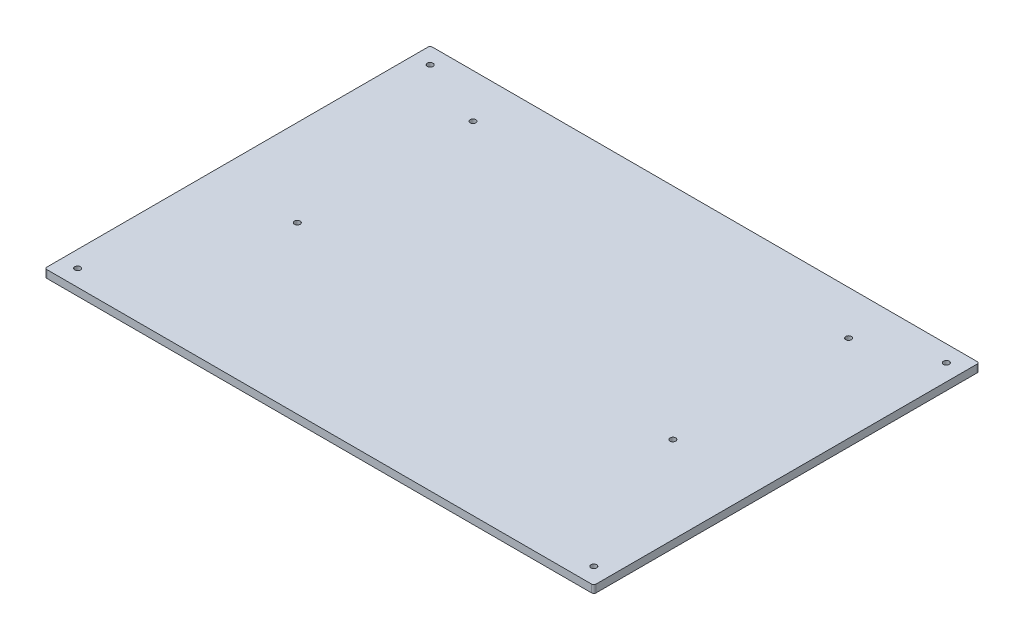
ISO-10303-21;
HEADER;
FILE_DESCRIPTION(('STEP AP214'),'2;1');
FILE_NAME('part.step','',(''),(''),'','','');
FILE_SCHEMA(('AUTOMOTIVE_DESIGN { 1 0 10303 214 1 1 1 1 }'));
ENDSEC;
DATA;
#1=APPLICATION_CONTEXT('core data for automotive mechanical design processes');
#2=APPLICATION_PROTOCOL_DEFINITION('international standard','automotive_design',2000,#1);
#3=PRODUCT_CONTEXT('',#1,'mechanical');
#4=PRODUCT('Part','Part','',(#3));
#5=PRODUCT_RELATED_PRODUCT_CATEGORY('part','',(#4));
#6=PRODUCT_DEFINITION_FORMATION('','',#4);
#7=PRODUCT_DEFINITION_CONTEXT('part definition',#1,'design');
#8=PRODUCT_DEFINITION('design','',#6,#7);
#9=PRODUCT_DEFINITION_SHAPE('','',#8);
#10=(LENGTH_UNIT() NAMED_UNIT(*) SI_UNIT(.MILLI.,.METRE.));
#11=(NAMED_UNIT(*) PLANE_ANGLE_UNIT() SI_UNIT($,.RADIAN.));
#12=(NAMED_UNIT(*) SI_UNIT($,.STERADIAN.) SOLID_ANGLE_UNIT());
#13=UNCERTAINTY_MEASURE_WITH_UNIT(LENGTH_MEASURE(1.E-05),#10,'distance_accuracy_value','');
#14=(GEOMETRIC_REPRESENTATION_CONTEXT(3) GLOBAL_UNCERTAINTY_ASSIGNED_CONTEXT((#13)) GLOBAL_UNIT_ASSIGNED_CONTEXT((#10,
#11,#12)) REPRESENTATION_CONTEXT('',''));
#15=CARTESIAN_POINT('',(0.,0.,0.));
#16=DIRECTION('',(0.,0.,1.));
#17=DIRECTION('',(1.,0.,0.));
#18=AXIS2_PLACEMENT_3D('',#15,#16,#17);
#19=CARTESIAN_POINT('',(0.,0.,0.));
#20=DIRECTION('',(0.,-1.,0.));
#21=DIRECTION('',(0.,0.,-1.));
#22=AXIS2_PLACEMENT_3D('',#19,#20,#21);
#23=PLANE('',#22);
#24=DIRECTION('',(-1.,0.,0.));
#25=VECTOR('',#24,1.);
#26=CARTESIAN_POINT('',(250.,0.,175.5));
#27=LINE('',#26,#25);
#28=CARTESIAN_POINT('',(248.,0.,175.5));
#29=VERTEX_POINT('',#28);
#30=CARTESIAN_POINT('',(-248.,0.,175.5));
#31=VERTEX_POINT('',#30);
#32=EDGE_CURVE('E115',#29,#31,#27,.T.);
#33=ORIENTED_EDGE('',*,*,#32,.T.);
#34=CARTESIAN_POINT('',(-248.,0.,173.5));
#35=DIRECTION('',(0.,-1.,0.));
#36=DIRECTION('',(0.,0.,-1.));
#37=AXIS2_PLACEMENT_3D('',#34,#35,#36);
#38=CIRCLE('',#37,2.);
#39=CARTESIAN_POINT('',(-250.,0.,173.5));
#40=VERTEX_POINT('',#39);
#41=EDGE_CURVE('E116',#40,#31,#38,.F.);
#42=ORIENTED_EDGE('',*,*,#41,.F.);
#43=DIRECTION('',(0.,0.,-1.));
#44=VECTOR('',#43,1.);
#45=CARTESIAN_POINT('',(-250.,0.,-175.5));
#46=LINE('',#45,#44);
#47=CARTESIAN_POINT('',(-250.,0.,-173.5));
#48=VERTEX_POINT('',#47);
#49=EDGE_CURVE('E110',#40,#48,#46,.T.);
#50=ORIENTED_EDGE('',*,*,#49,.T.);
#51=CARTESIAN_POINT('',(-248.,0.,-173.5));
#52=DIRECTION('',(0.,-1.,0.));
#53=DIRECTION('',(0.,0.,-1.));
#54=AXIS2_PLACEMENT_3D('',#51,#52,#53);
#55=CIRCLE('',#54,2.);
#56=CARTESIAN_POINT('',(-248.,0.,-175.5));
#57=VERTEX_POINT('',#56);
#58=EDGE_CURVE('E113',#57,#48,#55,.F.);
#59=ORIENTED_EDGE('',*,*,#58,.F.);
#60=DIRECTION('',(1.,0.,0.));
#61=VECTOR('',#60,1.);
#62=CARTESIAN_POINT('',(250.,0.,-175.5));
#63=LINE('',#62,#61);
#64=CARTESIAN_POINT('',(248.,0.,-175.5));
#65=VERTEX_POINT('',#64);
#66=EDGE_CURVE('E86',#57,#65,#63,.T.);
#67=ORIENTED_EDGE('',*,*,#66,.T.);
#68=CARTESIAN_POINT('',(248.,0.,-173.5));
#69=DIRECTION('',(0.,-1.,0.));
#70=DIRECTION('',(0.,0.,-1.));
#71=AXIS2_PLACEMENT_3D('',#68,#69,#70);
#72=CIRCLE('',#71,2.);
#73=CARTESIAN_POINT('',(250.,0.,-173.5));
#74=VERTEX_POINT('',#73);
#75=EDGE_CURVE('E80',#74,#65,#72,.F.);
#76=ORIENTED_EDGE('',*,*,#75,.F.);
#77=DIRECTION('',(0.,0.,1.));
#78=VECTOR('',#77,1.);
#79=CARTESIAN_POINT('',(250.,0.,-175.5));
#80=LINE('',#79,#78);
#81=CARTESIAN_POINT('',(250.,0.,173.5));
#82=VERTEX_POINT('',#81);
#83=EDGE_CURVE('E84',#74,#82,#80,.T.);
#84=ORIENTED_EDGE('',*,*,#83,.T.);
#85=CARTESIAN_POINT('',(248.,0.,173.5));
#86=DIRECTION('',(0.,-1.,0.));
#87=DIRECTION('',(0.,0.,-1.));
#88=AXIS2_PLACEMENT_3D('',#85,#86,#87);
#89=CIRCLE('',#88,2.);
#90=EDGE_CURVE('E99',#29,#82,#89,.F.);
#91=ORIENTED_EDGE('',*,*,#90,.F.);
#92=EDGE_LOOP('',(#33,#42,#50,#59,#67,#76,#84,#91));
#93=FACE_BOUND('',#92,.T.);
#94=CARTESIAN_POINT('',(-235.,0.,-160.5));
#95=DIRECTION('',(0.,-1.,0.));
#96=DIRECTION('',(0.,0.,-1.));
#97=AXIS2_PLACEMENT_3D('',#94,#95,#96);
#98=CIRCLE('',#97,2.59999999999999);
#99=CARTESIAN_POINT('',(-235.,0.,-163.1));
#100=VERTEX_POINT('',#99);
#101=EDGE_CURVE('E92',#100,#100,#98,.F.);
#102=ORIENTED_EDGE('',*,*,#101,.T.);
#103=EDGE_LOOP('',(#102));
#104=FACE_BOUND('',#103,.T.);
#105=CARTESIAN_POINT('',(235.,0.,-160.5));
#106=DIRECTION('',(0.,-1.,0.));
#107=DIRECTION('',(0.,0.,-1.));
#108=AXIS2_PLACEMENT_3D('',#105,#106,#107);
#109=CIRCLE('',#108,2.59999999999999);
#110=CARTESIAN_POINT('',(235.,0.,-163.1));
#111=VERTEX_POINT('',#110);
#112=EDGE_CURVE('E161',#111,#111,#109,.F.);
#113=ORIENTED_EDGE('',*,*,#112,.T.);
#114=EDGE_LOOP('',(#113));
#115=FACE_BOUND('',#114,.T.);
#116=CARTESIAN_POINT('',(235.,0.,160.5));
#117=DIRECTION('',(0.,-1.,0.));
#118=DIRECTION('',(0.,0.,-1.));
#119=AXIS2_PLACEMENT_3D('',#116,#117,#118);
#120=CIRCLE('',#119,2.59999999999999);
#121=CARTESIAN_POINT('',(235.,0.,157.9));
#122=VERTEX_POINT('',#121);
#123=EDGE_CURVE('E164',#122,#122,#120,.F.);
#124=ORIENTED_EDGE('',*,*,#123,.T.);
#125=EDGE_LOOP('',(#124));
#126=FACE_BOUND('',#125,.T.);
#127=CARTESIAN_POINT('',(-235.,0.,160.5));
#128=DIRECTION('',(0.,-1.,0.));
#129=DIRECTION('',(0.,0.,-1.));
#130=AXIS2_PLACEMENT_3D('',#127,#128,#129);
#131=CIRCLE('',#130,2.59999999999999);
#132=CARTESIAN_POINT('',(-235.,0.,157.9));
#133=VERTEX_POINT('',#132);
#134=EDGE_CURVE('E167',#133,#133,#131,.F.);
#135=ORIENTED_EDGE('',*,*,#134,.T.);
#136=EDGE_LOOP('',(#135));
#137=FACE_BOUND('',#136,.T.);
#138=CARTESIAN_POINT('',(-171.,0.,-135.5));
#139=DIRECTION('',(0.,1.,0.));
#140=DIRECTION('',(0.,0.,1.));
#141=AXIS2_PLACEMENT_3D('',#138,#139,#140);
#142=CIRCLE('',#141,2.59999999999999);
#143=CARTESIAN_POINT('',(-171.,0.,-132.9));
#144=VERTEX_POINT('',#143);
#145=EDGE_CURVE('E170',#144,#144,#142,.T.);
#146=ORIENTED_EDGE('',*,*,#145,.T.);
#147=EDGE_LOOP('',(#146));
#148=FACE_BOUND('',#147,.T.);
#149=CARTESIAN_POINT('',(171.,0.,-135.5));
#150=DIRECTION('',(0.,1.,0.));
#151=DIRECTION('',(0.,0.,1.));
#152=AXIS2_PLACEMENT_3D('',#149,#150,#151);
#153=CIRCLE('',#152,2.59999999999999);
#154=CARTESIAN_POINT('',(171.,0.,-132.9));
#155=VERTEX_POINT('',#154);
#156=EDGE_CURVE('E173',#155,#155,#153,.T.);
#157=ORIENTED_EDGE('',*,*,#156,.T.);
#158=EDGE_LOOP('',(#157));
#159=FACE_BOUND('',#158,.T.);
#160=CARTESIAN_POINT('',(171.,0.,24.4999999999999));
#161=DIRECTION('',(0.,1.,0.));
#162=DIRECTION('',(0.,0.,1.));
#163=AXIS2_PLACEMENT_3D('',#160,#161,#162);
#164=CIRCLE('',#163,2.59999999999999);
#165=CARTESIAN_POINT('',(171.,0.,27.0999999999999));
#166=VERTEX_POINT('',#165);
#167=EDGE_CURVE('E175',#166,#166,#164,.T.);
#168=ORIENTED_EDGE('',*,*,#167,.T.);
#169=EDGE_LOOP('',(#168));
#170=FACE_BOUND('',#169,.T.);
#171=CARTESIAN_POINT('',(-171.,0.,24.4999999999999));
#172=DIRECTION('',(0.,1.,0.));
#173=DIRECTION('',(0.,0.,1.));
#174=AXIS2_PLACEMENT_3D('',#171,#172,#173);
#175=CIRCLE('',#174,2.59999999999999);
#176=CARTESIAN_POINT('',(-171.,0.,27.0999999999999));
#177=VERTEX_POINT('',#176);
#178=EDGE_CURVE('E20',#177,#177,#175,.T.);
#179=ORIENTED_EDGE('',*,*,#178,.T.);
#180=EDGE_LOOP('',(#179));
#181=FACE_BOUND('',#180,.T.);
#182=ADVANCED_FACE('F17',(#93,#104,#115,#126,#137,#148,#159,#170,#181),#23,.T.);
#183=CARTESIAN_POINT('',(-171.,-0.00100000000000013,24.4999999999999));
#184=DIRECTION('',(0.,1.,0.));
#185=DIRECTION('',(0.,0.,1.));
#186=AXIS2_PLACEMENT_3D('',#183,#184,#185);
#187=CYLINDRICAL_SURFACE('',#186,2.59999999999999);
#188=ORIENTED_EDGE('',*,*,#178,.F.);
#189=EDGE_LOOP('',(#188));
#190=FACE_BOUND('',#189,.T.);
#191=CARTESIAN_POINT('',(-171.,7.,24.4999999999999));
#192=DIRECTION('',(0.,1.,0.));
#193=DIRECTION('',(0.,0.,1.));
#194=AXIS2_PLACEMENT_3D('',#191,#192,#193);
#195=CIRCLE('',#194,2.59999999999999);
#196=CARTESIAN_POINT('',(-171.,7.,27.0999999999999));
#197=VERTEX_POINT('',#196);
#198=EDGE_CURVE('E109',#197,#197,#195,.T.);
#199=ORIENTED_EDGE('',*,*,#198,.T.);
#200=EDGE_LOOP('',(#199));
#201=FACE_BOUND('',#200,.T.);
#202=ADVANCED_FACE('F183',(#190,#201),#187,.F.);
#203=CARTESIAN_POINT('',(171.,-0.00100000000000013,24.4999999999999));
#204=DIRECTION('',(0.,1.,0.));
#205=DIRECTION('',(0.,0.,1.));
#206=AXIS2_PLACEMENT_3D('',#203,#204,#205);
#207=CYLINDRICAL_SURFACE('',#206,2.59999999999999);
#208=ORIENTED_EDGE('',*,*,#167,.F.);
#209=EDGE_LOOP('',(#208));
#210=FACE_BOUND('',#209,.T.);
#211=CARTESIAN_POINT('',(171.,7.,24.4999999999999));
#212=DIRECTION('',(0.,1.,0.));
#213=DIRECTION('',(0.,0.,1.));
#214=AXIS2_PLACEMENT_3D('',#211,#212,#213);
#215=CIRCLE('',#214,2.59999999999999);
#216=CARTESIAN_POINT('',(171.,7.,27.0999999999999));
#217=VERTEX_POINT('',#216);
#218=EDGE_CURVE('E149',#217,#217,#215,.T.);
#219=ORIENTED_EDGE('',*,*,#218,.T.);
#220=EDGE_LOOP('',(#219));
#221=FACE_BOUND('',#220,.T.);
#222=ADVANCED_FACE('F186',(#210,#221),#207,.F.);
#223=CARTESIAN_POINT('',(171.,-0.00100000000000013,-135.5));
#224=DIRECTION('',(0.,1.,0.));
#225=DIRECTION('',(0.,0.,1.));
#226=AXIS2_PLACEMENT_3D('',#223,#224,#225);
#227=CYLINDRICAL_SURFACE('',#226,2.59999999999999);
#228=ORIENTED_EDGE('',*,*,#156,.F.);
#229=EDGE_LOOP('',(#228));
#230=FACE_BOUND('',#229,.T.);
#231=CARTESIAN_POINT('',(171.,7.,-135.5));
#232=DIRECTION('',(0.,1.,0.));
#233=DIRECTION('',(0.,0.,1.));
#234=AXIS2_PLACEMENT_3D('',#231,#232,#233);
#235=CIRCLE('',#234,2.59999999999999);
#236=CARTESIAN_POINT('',(171.,7.,-132.9));
#237=VERTEX_POINT('',#236);
#238=EDGE_CURVE('E146',#237,#237,#235,.T.);
#239=ORIENTED_EDGE('',*,*,#238,.T.);
#240=EDGE_LOOP('',(#239));
#241=FACE_BOUND('',#240,.T.);
#242=ADVANCED_FACE('F245',(#230,#241),#227,.F.);
#243=CARTESIAN_POINT('',(-171.,-0.00100000000000013,-135.5));
#244=DIRECTION('',(0.,1.,0.));
#245=DIRECTION('',(0.,0.,1.));
#246=AXIS2_PLACEMENT_3D('',#243,#244,#245);
#247=CYLINDRICAL_SURFACE('',#246,2.59999999999999);
#248=ORIENTED_EDGE('',*,*,#145,.F.);
#249=EDGE_LOOP('',(#248));
#250=FACE_BOUND('',#249,.T.);
#251=CARTESIAN_POINT('',(-171.,7.,-135.5));
#252=DIRECTION('',(0.,1.,0.));
#253=DIRECTION('',(0.,0.,1.));
#254=AXIS2_PLACEMENT_3D('',#251,#252,#253);
#255=CIRCLE('',#254,2.59999999999999);
#256=CARTESIAN_POINT('',(-171.,7.,-132.9));
#257=VERTEX_POINT('',#256);
#258=EDGE_CURVE('E143',#257,#257,#255,.T.);
#259=ORIENTED_EDGE('',*,*,#258,.T.);
#260=EDGE_LOOP('',(#259));
#261=FACE_BOUND('',#260,.T.);
#262=ADVANCED_FACE('F241',(#250,#261),#247,.F.);
#263=CARTESIAN_POINT('',(-235.,14.3539105243401,160.5));
#264=DIRECTION('',(0.,-1.,0.));
#265=DIRECTION('',(0.,0.,-1.));
#266=AXIS2_PLACEMENT_3D('',#263,#264,#265);
#267=CYLINDRICAL_SURFACE('',#266,2.59999999999999);
#268=CARTESIAN_POINT('',(-235.,7.,160.5));
#269=DIRECTION('',(0.,-1.,0.));
#270=DIRECTION('',(0.,0.,-1.));
#271=AXIS2_PLACEMENT_3D('',#268,#269,#270);
#272=CIRCLE('',#271,2.59999999999999);
#273=CARTESIAN_POINT('',(-235.,7.,157.9));
#274=VERTEX_POINT('',#273);
#275=EDGE_CURVE('E140',#274,#274,#272,.F.);
#276=ORIENTED_EDGE('',*,*,#275,.T.);
#277=EDGE_LOOP('',(#276));
#278=FACE_BOUND('',#277,.T.);
#279=ORIENTED_EDGE('',*,*,#134,.F.);
#280=EDGE_LOOP('',(#279));
#281=FACE_BOUND('',#280,.T.);
#282=ADVANCED_FACE('F237',(#278,#281),#267,.F.);
#283=CARTESIAN_POINT('',(235.,14.3539105243401,160.5));
#284=DIRECTION('',(0.,-1.,0.));
#285=DIRECTION('',(0.,0.,-1.));
#286=AXIS2_PLACEMENT_3D('',#283,#284,#285);
#287=CYLINDRICAL_SURFACE('',#286,2.59999999999999);
#288=CARTESIAN_POINT('',(235.,7.,160.5));
#289=DIRECTION('',(0.,-1.,0.));
#290=DIRECTION('',(0.,0.,-1.));
#291=AXIS2_PLACEMENT_3D('',#288,#289,#290);
#292=CIRCLE('',#291,2.59999999999999);
#293=CARTESIAN_POINT('',(235.,7.,157.9));
#294=VERTEX_POINT('',#293);
#295=EDGE_CURVE('E137',#294,#294,#292,.F.);
#296=ORIENTED_EDGE('',*,*,#295,.T.);
#297=EDGE_LOOP('',(#296));
#298=FACE_BOUND('',#297,.T.);
#299=ORIENTED_EDGE('',*,*,#123,.F.);
#300=EDGE_LOOP('',(#299));
#301=FACE_BOUND('',#300,.T.);
#302=ADVANCED_FACE('F233',(#298,#301),#287,.F.);
#303=CARTESIAN_POINT('',(235.,14.3539105243401,-160.5));
#304=DIRECTION('',(0.,-1.,0.));
#305=DIRECTION('',(0.,0.,-1.));
#306=AXIS2_PLACEMENT_3D('',#303,#304,#305);
#307=CYLINDRICAL_SURFACE('',#306,2.59999999999999);
#308=CARTESIAN_POINT('',(235.,7.,-160.5));
#309=DIRECTION('',(0.,-1.,0.));
#310=DIRECTION('',(0.,0.,-1.));
#311=AXIS2_PLACEMENT_3D('',#308,#309,#310);
#312=CIRCLE('',#311,2.59999999999999);
#313=CARTESIAN_POINT('',(235.,7.,-163.1));
#314=VERTEX_POINT('',#313);
#315=EDGE_CURVE('E134',#314,#314,#312,.F.);
#316=ORIENTED_EDGE('',*,*,#315,.T.);
#317=EDGE_LOOP('',(#316));
#318=FACE_BOUND('',#317,.T.);
#319=ORIENTED_EDGE('',*,*,#112,.F.);
#320=EDGE_LOOP('',(#319));
#321=FACE_BOUND('',#320,.T.);
#322=ADVANCED_FACE('F229',(#318,#321),#307,.F.);
#323=CARTESIAN_POINT('',(-235.,14.3539105243401,-160.5));
#324=DIRECTION('',(0.,-1.,0.));
#325=DIRECTION('',(0.,0.,-1.));
#326=AXIS2_PLACEMENT_3D('',#323,#324,#325);
#327=CYLINDRICAL_SURFACE('',#326,2.59999999999999);
#328=CARTESIAN_POINT('',(-235.,7.,-160.5));
#329=DIRECTION('',(0.,-1.,0.));
#330=DIRECTION('',(0.,0.,-1.));
#331=AXIS2_PLACEMENT_3D('',#328,#329,#330);
#332=CIRCLE('',#331,2.59999999999999);
#333=CARTESIAN_POINT('',(-235.,7.,-163.1));
#334=VERTEX_POINT('',#333);
#335=EDGE_CURVE('E131',#334,#334,#332,.F.);
#336=ORIENTED_EDGE('',*,*,#335,.T.);
#337=EDGE_LOOP('',(#336));
#338=FACE_BOUND('',#337,.T.);
#339=ORIENTED_EDGE('',*,*,#101,.F.);
#340=EDGE_LOOP('',(#339));
#341=FACE_BOUND('',#340,.T.);
#342=ADVANCED_FACE('F226',(#338,#341),#327,.F.);
#343=CARTESIAN_POINT('',(248.,7.,-173.5));
#344=DIRECTION('',(0.,-1.,0.));
#345=DIRECTION('',(0.,0.,-1.));
#346=AXIS2_PLACEMENT_3D('',#343,#344,#345);
#347=CYLINDRICAL_SURFACE('',#346,2.);
#348=ORIENTED_EDGE('',*,*,#75,.T.);
#349=DIRECTION('',(0.,1.,0.));
#350=VECTOR('',#349,1.);
#351=CARTESIAN_POINT('',(248.,7.,-175.5));
#352=LINE('',#351,#350);
#353=CARTESIAN_POINT('',(248.,7.,-175.5));
#354=VERTEX_POINT('',#353);
#355=EDGE_CURVE('E414',#65,#354,#352,.T.);
#356=ORIENTED_EDGE('',*,*,#355,.T.);
#357=CARTESIAN_POINT('',(248.,7.,-173.5));
#358=DIRECTION('',(0.,-1.,0.));
#359=DIRECTION('',(0.,0.,-1.));
#360=AXIS2_PLACEMENT_3D('',#357,#358,#359);
#361=CIRCLE('',#360,2.);
#362=CARTESIAN_POINT('',(250.,7.,-173.5));
#363=VERTEX_POINT('',#362);
#364=EDGE_CURVE('E103',#354,#363,#361,.T.);
#365=ORIENTED_EDGE('',*,*,#364,.T.);
#366=DIRECTION('',(0.,1.,0.));
#367=VECTOR('',#366,1.);
#368=CARTESIAN_POINT('',(250.,7.,-173.5));
#369=LINE('',#368,#367);
#370=EDGE_CURVE('E91',#363,#74,#369,.F.);
#371=ORIENTED_EDGE('',*,*,#370,.T.);
#372=EDGE_LOOP('',(#348,#356,#365,#371));
#373=FACE_BOUND('',#372,.T.);
#374=ADVANCED_FACE('F102',(#373),#347,.T.);
#375=CARTESIAN_POINT('',(250.,7.,-175.5));
#376=DIRECTION('',(-1.,0.,0.));
#377=DIRECTION('',(0.,0.,1.));
#378=AXIS2_PLACEMENT_3D('',#375,#376,#377);
#379=PLANE('',#378);
#380=ORIENTED_EDGE('',*,*,#370,.F.);
#381=DIRECTION('',(0.,0.,-1.));
#382=VECTOR('',#381,1.);
#383=CARTESIAN_POINT('',(250.,7.,0.));
#384=LINE('',#383,#382);
#385=CARTESIAN_POINT('',(250.,7.,173.5));
#386=VERTEX_POINT('',#385);
#387=EDGE_CURVE('E129',#363,#386,#384,.F.);
#388=ORIENTED_EDGE('',*,*,#387,.T.);
#389=DIRECTION('',(0.,-1.,0.));
#390=VECTOR('',#389,1.);
#391=CARTESIAN_POINT('',(250.,7.,173.5));
#392=LINE('',#391,#390);
#393=EDGE_CURVE('E98',#82,#386,#392,.F.);
#394=ORIENTED_EDGE('',*,*,#393,.F.);
#395=ORIENTED_EDGE('',*,*,#83,.F.);
#396=EDGE_LOOP('',(#380,#388,#394,#395));
#397=FACE_BOUND('',#396,.T.);
#398=ADVANCED_FACE('F95',(#397),#379,.F.);
#399=CARTESIAN_POINT('',(248.,7.,173.5));
#400=DIRECTION('',(0.,-1.,0.));
#401=DIRECTION('',(0.,0.,-1.));
#402=AXIS2_PLACEMENT_3D('',#399,#400,#401);
#403=CYLINDRICAL_SURFACE('',#402,2.);
#404=ORIENTED_EDGE('',*,*,#90,.T.);
#405=ORIENTED_EDGE('',*,*,#393,.T.);
#406=CARTESIAN_POINT('',(248.,7.,173.5));
#407=DIRECTION('',(0.,-1.,0.));
#408=DIRECTION('',(0.,0.,-1.));
#409=AXIS2_PLACEMENT_3D('',#406,#407,#408);
#410=CIRCLE('',#409,2.);
#411=CARTESIAN_POINT('',(248.,7.,175.5));
#412=VERTEX_POINT('',#411);
#413=EDGE_CURVE('E126',#386,#412,#410,.T.);
#414=ORIENTED_EDGE('',*,*,#413,.T.);
#415=DIRECTION('',(0.,1.,0.));
#416=VECTOR('',#415,1.);
#417=CARTESIAN_POINT('',(248.,7.,175.5));
#418=LINE('',#417,#416);
#419=EDGE_CURVE('E117',#412,#29,#418,.F.);
#420=ORIENTED_EDGE('',*,*,#419,.T.);
#421=EDGE_LOOP('',(#404,#405,#414,#420));
#422=FACE_BOUND('',#421,.T.);
#423=ADVANCED_FACE('F217',(#422),#403,.T.);
#424=CARTESIAN_POINT('',(250.,7.,175.5));
#425=DIRECTION('',(0.,0.,-1.));
#426=DIRECTION('',(-1.,0.,0.));
#427=AXIS2_PLACEMENT_3D('',#424,#425,#426);
#428=PLANE('',#427);
#429=ORIENTED_EDGE('',*,*,#419,.F.);
#430=DIRECTION('',(1.,0.,0.));
#431=VECTOR('',#430,1.);
#432=CARTESIAN_POINT('',(0.,7.,175.5));
#433=LINE('',#432,#431);
#434=CARTESIAN_POINT('',(-248.,7.,175.5));
#435=VERTEX_POINT('',#434);
#436=EDGE_CURVE('E125',#412,#435,#433,.F.);
#437=ORIENTED_EDGE('',*,*,#436,.T.);
#438=DIRECTION('',(0.,-1.,0.));
#439=VECTOR('',#438,1.);
#440=CARTESIAN_POINT('',(-248.,7.,175.5));
#441=LINE('',#440,#439);
#442=EDGE_CURVE('E157',#31,#435,#441,.F.);
#443=ORIENTED_EDGE('',*,*,#442,.F.);
#444=ORIENTED_EDGE('',*,*,#32,.F.);
#445=EDGE_LOOP('',(#429,#437,#443,#444));
#446=FACE_BOUND('',#445,.T.);
#447=ADVANCED_FACE('F213',(#446),#428,.F.);
#448=CARTESIAN_POINT('',(-248.,7.,173.5));
#449=DIRECTION('',(0.,-1.,0.));
#450=DIRECTION('',(0.,0.,-1.));
#451=AXIS2_PLACEMENT_3D('',#448,#449,#450);
#452=CYLINDRICAL_SURFACE('',#451,2.);
#453=ORIENTED_EDGE('',*,*,#41,.T.);
#454=ORIENTED_EDGE('',*,*,#442,.T.);
#455=CARTESIAN_POINT('',(-248.,7.,173.5));
#456=DIRECTION('',(0.,-1.,0.));
#457=DIRECTION('',(0.,0.,-1.));
#458=AXIS2_PLACEMENT_3D('',#455,#456,#457);
#459=CIRCLE('',#458,2.);
#460=CARTESIAN_POINT('',(-250.,7.,173.5));
#461=VERTEX_POINT('',#460);
#462=EDGE_CURVE('E122',#435,#461,#459,.T.);
#463=ORIENTED_EDGE('',*,*,#462,.T.);
#464=DIRECTION('',(0.,1.,0.));
#465=VECTOR('',#464,1.);
#466=CARTESIAN_POINT('',(-250.,7.,173.5));
#467=LINE('',#466,#465);
#468=EDGE_CURVE('E114',#461,#40,#467,.F.);
#469=ORIENTED_EDGE('',*,*,#468,.T.);
#470=EDGE_LOOP('',(#453,#454,#463,#469));
#471=FACE_BOUND('',#470,.T.);
#472=ADVANCED_FACE('F209',(#471),#452,.T.);
#473=CARTESIAN_POINT('',(-250.,7.,-175.5));
#474=DIRECTION('',(1.,0.,0.));
#475=DIRECTION('',(0.,0.,-1.));
#476=AXIS2_PLACEMENT_3D('',#473,#474,#475);
#477=PLANE('',#476);
#478=DIRECTION('',(0.,-1.,0.));
#479=VECTOR('',#478,1.);
#480=CARTESIAN_POINT('',(-250.,7.,-173.5));
#481=LINE('',#480,#479);
#482=CARTESIAN_POINT('',(-250.,7.,-173.5));
#483=VERTEX_POINT('',#482);
#484=EDGE_CURVE('E155',#48,#483,#481,.F.);
#485=ORIENTED_EDGE('',*,*,#484,.F.);
#486=ORIENTED_EDGE('',*,*,#49,.F.);
#487=ORIENTED_EDGE('',*,*,#468,.F.);
#488=DIRECTION('',(0.,0.,-1.));
#489=VECTOR('',#488,1.);
#490=CARTESIAN_POINT('',(-250.,7.,0.));
#491=LINE('',#490,#489);
#492=EDGE_CURVE('E121',#461,#483,#491,.T.);
#493=ORIENTED_EDGE('',*,*,#492,.T.);
#494=EDGE_LOOP('',(#485,#486,#487,#493));
#495=FACE_BOUND('',#494,.T.);
#496=ADVANCED_FACE('F205',(#495),#477,.F.);
#497=CARTESIAN_POINT('',(-248.,7.,-173.5));
#498=DIRECTION('',(0.,-1.,0.));
#499=DIRECTION('',(0.,0.,-1.));
#500=AXIS2_PLACEMENT_3D('',#497,#498,#499);
#501=CYLINDRICAL_SURFACE('',#500,2.);
#502=ORIENTED_EDGE('',*,*,#58,.T.);
#503=ORIENTED_EDGE('',*,*,#484,.T.);
#504=CARTESIAN_POINT('',(-248.,7.,-173.5));
#505=DIRECTION('',(0.,-1.,0.));
#506=DIRECTION('',(0.,0.,-1.));
#507=AXIS2_PLACEMENT_3D('',#504,#505,#506);
#508=CIRCLE('',#507,2.);
#509=CARTESIAN_POINT('',(-248.,7.,-175.5));
#510=VERTEX_POINT('',#509);
#511=EDGE_CURVE('E26',#483,#510,#508,.T.);
#512=ORIENTED_EDGE('',*,*,#511,.T.);
#513=DIRECTION('',(0.,1.,0.));
#514=VECTOR('',#513,1.);
#515=CARTESIAN_POINT('',(-248.,7.,-175.5));
#516=LINE('',#515,#514);
#517=EDGE_CURVE('E34',#510,#57,#516,.F.);
#518=ORIENTED_EDGE('',*,*,#517,.T.);
#519=EDGE_LOOP('',(#502,#503,#512,#518));
#520=FACE_BOUND('',#519,.T.);
#521=ADVANCED_FACE('F198',(#520),#501,.T.);
#522=CARTESIAN_POINT('',(250.,7.,-175.5));
#523=DIRECTION('',(0.,0.,1.));
#524=DIRECTION('',(1.,0.,0.));
#525=AXIS2_PLACEMENT_3D('',#522,#523,#524);
#526=PLANE('',#525);
#527=ORIENTED_EDGE('',*,*,#517,.F.);
#528=DIRECTION('',(1.,0.,0.));
#529=VECTOR('',#528,1.);
#530=CARTESIAN_POINT('',(0.,7.,-175.5));
#531=LINE('',#530,#529);
#532=EDGE_CURVE('E11',#510,#354,#531,.T.);
#533=ORIENTED_EDGE('',*,*,#532,.T.);
#534=ORIENTED_EDGE('',*,*,#355,.F.);
#535=ORIENTED_EDGE('',*,*,#66,.F.);
#536=EDGE_LOOP('',(#527,#533,#534,#535));
#537=FACE_BOUND('',#536,.T.);
#538=ADVANCED_FACE('F191',(#537),#526,.F.);
#539=CARTESIAN_POINT('',(0.,7.,0.));
#540=DIRECTION('',(0.,-1.,0.));
#541=DIRECTION('',(0.,0.,-1.));
#542=AXIS2_PLACEMENT_3D('',#539,#540,#541);
#543=PLANE('',#542);
#544=ORIENTED_EDGE('',*,*,#511,.F.);
#545=ORIENTED_EDGE('',*,*,#492,.F.);
#546=ORIENTED_EDGE('',*,*,#462,.F.);
#547=ORIENTED_EDGE('',*,*,#436,.F.);
#548=ORIENTED_EDGE('',*,*,#413,.F.);
#549=ORIENTED_EDGE('',*,*,#387,.F.);
#550=ORIENTED_EDGE('',*,*,#364,.F.);
#551=ORIENTED_EDGE('',*,*,#532,.F.);
#552=EDGE_LOOP('',(#544,#545,#546,#547,#548,#549,#550,#551));
#553=FACE_BOUND('',#552,.T.);
#554=ORIENTED_EDGE('',*,*,#335,.F.);
#555=EDGE_LOOP('',(#554));
#556=FACE_BOUND('',#555,.T.);
#557=ORIENTED_EDGE('',*,*,#315,.F.);
#558=EDGE_LOOP('',(#557));
#559=FACE_BOUND('',#558,.T.);
#560=ORIENTED_EDGE('',*,*,#295,.F.);
#561=EDGE_LOOP('',(#560));
#562=FACE_BOUND('',#561,.T.);
#563=ORIENTED_EDGE('',*,*,#275,.F.);
#564=EDGE_LOOP('',(#563));
#565=FACE_BOUND('',#564,.T.);
#566=ORIENTED_EDGE('',*,*,#258,.F.);
#567=EDGE_LOOP('',(#566));
#568=FACE_BOUND('',#567,.T.);
#569=ORIENTED_EDGE('',*,*,#238,.F.);
#570=EDGE_LOOP('',(#569));
#571=FACE_BOUND('',#570,.T.);
#572=ORIENTED_EDGE('',*,*,#218,.F.);
#573=EDGE_LOOP('',(#572));
#574=FACE_BOUND('',#573,.T.);
#575=ORIENTED_EDGE('',*,*,#198,.F.);
#576=EDGE_LOOP('',(#575));
#577=FACE_BOUND('',#576,.T.);
#578=ADVANCED_FACE('F189',(#553,#556,#559,#562,#565,#568,#571,#574,#577),#543,.F.);
#579=CLOSED_SHELL('',(#182,#202,#222,#242,#262,#282,#302,#322,#342,#374,#398,#423,#447,#472,
#496,#521,#538,#578));
#580=MANIFOLD_SOLID_BREP('B1',#579);
#581=ADVANCED_BREP_SHAPE_REPRESENTATION('',(#18,#580),#14);
#582=SHAPE_DEFINITION_REPRESENTATION(#9,#581);
ENDSEC;
END-ISO-10303-21;
